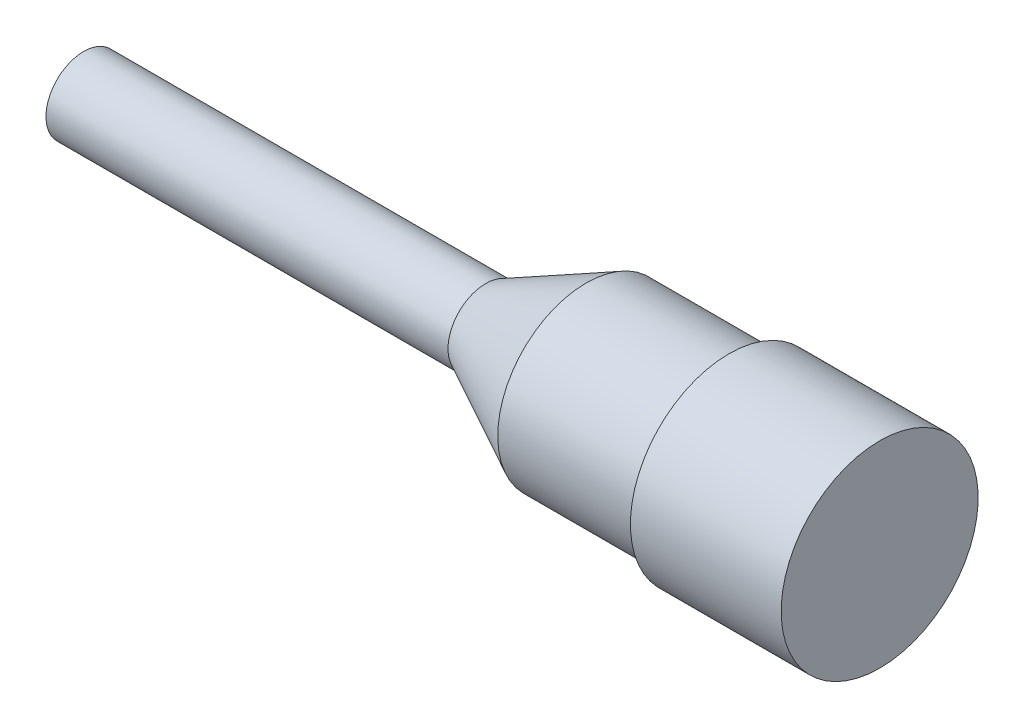
ISO-10303-21;
HEADER;
FILE_DESCRIPTION(('STEP AP214'),'2;1');
FILE_NAME('part.step','',(''),(''),'','','');
FILE_SCHEMA(('AUTOMOTIVE_DESIGN { 1 0 10303 214 1 1 1 1 }'));
ENDSEC;
DATA;
#1=APPLICATION_CONTEXT('core data for automotive mechanical design processes');
#2=APPLICATION_PROTOCOL_DEFINITION('international standard','automotive_design',2000,#1);
#3=PRODUCT_CONTEXT('',#1,'mechanical');
#4=PRODUCT('Part','Part','',(#3));
#5=PRODUCT_RELATED_PRODUCT_CATEGORY('part','',(#4));
#6=PRODUCT_DEFINITION_FORMATION('','',#4);
#7=PRODUCT_DEFINITION_CONTEXT('part definition',#1,'design');
#8=PRODUCT_DEFINITION('design','',#6,#7);
#9=PRODUCT_DEFINITION_SHAPE('','',#8);
#10=(LENGTH_UNIT() NAMED_UNIT(*) SI_UNIT(.MILLI.,.METRE.));
#11=(NAMED_UNIT(*) PLANE_ANGLE_UNIT() SI_UNIT($,.RADIAN.));
#12=(NAMED_UNIT(*) SI_UNIT($,.STERADIAN.) SOLID_ANGLE_UNIT());
#13=UNCERTAINTY_MEASURE_WITH_UNIT(LENGTH_MEASURE(1.E-05),#10,'distance_accuracy_value','');
#14=(GEOMETRIC_REPRESENTATION_CONTEXT(3) GLOBAL_UNCERTAINTY_ASSIGNED_CONTEXT((#13)) GLOBAL_UNIT_ASSIGNED_CONTEXT((#10,
#11,#12)) REPRESENTATION_CONTEXT('',''));
#15=CARTESIAN_POINT('',(0.,0.,0.));
#16=DIRECTION('',(0.,0.,1.));
#17=DIRECTION('',(1.,0.,0.));
#18=AXIS2_PLACEMENT_3D('',#15,#16,#17);
#19=CARTESIAN_POINT('',(0.,12.446,0.));
#20=DIRECTION('',(1.,0.,0.));
#21=DIRECTION('',(0.,1.,0.));
#22=AXIS2_PLACEMENT_3D('',#19,#20,#21);
#23=PLANE('',#22);
#24=CARTESIAN_POINT('',(0.,0.,0.));
#25=DIRECTION('',(1.,0.,0.));
#26=DIRECTION('',(0.,1.,0.));
#27=AXIS2_PLACEMENT_3D('',#24,#25,#26);
#28=CIRCLE('',#27,12.446);
#29=CARTESIAN_POINT('',(0.,12.446,0.));
#30=VERTEX_POINT('',#29);
#31=EDGE_CURVE('E56',#30,#30,#28,.T.);
#32=ORIENTED_EDGE('',*,*,#31,.T.);
#33=EDGE_LOOP('',(#32));
#34=FACE_BOUND('',#33,.T.);
#35=ADVANCED_FACE('F34',(#34),#23,.T.);
#36=CARTESIAN_POINT('',(-100.584,0.,0.));
#37=DIRECTION('',(-1.,0.,0.));
#38=DIRECTION('',(0.,-1.,0.));
#39=AXIS2_PLACEMENT_3D('',#36,#37,#38);
#40=PLANE('',#39);
#41=CARTESIAN_POINT('',(-100.584,0.,0.));
#42=DIRECTION('',(1.,0.,0.));
#43=DIRECTION('',(0.,1.,0.));
#44=AXIS2_PLACEMENT_3D('',#41,#42,#43);
#45=CIRCLE('',#44,4.76250000000001);
#46=CARTESIAN_POINT('',(-100.584,4.76249999999999,0.));
#47=VERTEX_POINT('',#46);
#48=EDGE_CURVE('E10',#47,#47,#45,.T.);
#49=ORIENTED_EDGE('',*,*,#48,.F.);
#50=EDGE_LOOP('',(#49));
#51=FACE_BOUND('',#50,.T.);
#52=ADVANCED_FACE('F73',(#51),#40,.T.);
#53=CARTESIAN_POINT('',(0.,0.,0.));
#54=DIRECTION('',(1.,0.,0.));
#55=DIRECTION('',(0.,1.,0.));
#56=AXIS2_PLACEMENT_3D('',#53,#54,#55);
#57=CYLINDRICAL_SURFACE('',#56,4.7625);
#58=ORIENTED_EDGE('',*,*,#48,.T.);
#59=EDGE_LOOP('',(#58));
#60=FACE_BOUND('',#59,.T.);
#61=CARTESIAN_POINT('',(-49.784,0.,0.));
#62=DIRECTION('',(1.,0.,0.));
#63=DIRECTION('',(0.,1.,0.));
#64=AXIS2_PLACEMENT_3D('',#61,#62,#63);
#65=CIRCLE('',#64,4.7625);
#66=CARTESIAN_POINT('',(-49.784,4.76249999999999,0.));
#67=VERTEX_POINT('',#66);
#68=EDGE_CURVE('E40',#67,#67,#65,.T.);
#69=ORIENTED_EDGE('',*,*,#68,.F.);
#70=EDGE_LOOP('',(#69));
#71=FACE_BOUND('',#70,.T.);
#72=ADVANCED_FACE('F77',(#60,#71),#57,.T.);
#73=CARTESIAN_POINT('',(-37.084,0.,0.));
#74=DIRECTION('',(1.,0.,0.));
#75=DIRECTION('',(0.,1.,0.));
#76=AXIS2_PLACEMENT_3D('',#73,#74,#75);
#77=CONICAL_SURFACE('',#76,11.176,0.467639603763229);
#78=ORIENTED_EDGE('',*,*,#68,.T.);
#79=EDGE_LOOP('',(#78));
#80=FACE_BOUND('',#79,.T.);
#81=CARTESIAN_POINT('',(-37.084,0.,0.));
#82=DIRECTION('',(1.,0.,0.));
#83=DIRECTION('',(0.,1.,0.));
#84=AXIS2_PLACEMENT_3D('',#81,#82,#83);
#85=CIRCLE('',#84,11.176);
#86=CARTESIAN_POINT('',(-37.084,11.176,0.));
#87=VERTEX_POINT('',#86);
#88=EDGE_CURVE('E44',#87,#87,#85,.T.);
#89=ORIENTED_EDGE('',*,*,#88,.F.);
#90=EDGE_LOOP('',(#89));
#91=FACE_BOUND('',#90,.T.);
#92=ADVANCED_FACE('F82',(#80,#91),#77,.T.);
#93=CARTESIAN_POINT('',(0.,0.,0.));
#94=DIRECTION('',(1.,0.,0.));
#95=DIRECTION('',(0.,1.,0.));
#96=AXIS2_PLACEMENT_3D('',#93,#94,#95);
#97=CYLINDRICAL_SURFACE('',#96,11.176);
#98=ORIENTED_EDGE('',*,*,#88,.T.);
#99=EDGE_LOOP('',(#98));
#100=FACE_BOUND('',#99,.T.);
#101=CARTESIAN_POINT('',(-19.05,0.,0.));
#102=DIRECTION('',(1.,0.,0.));
#103=DIRECTION('',(0.,1.,0.));
#104=AXIS2_PLACEMENT_3D('',#101,#102,#103);
#105=CIRCLE('',#104,11.176);
#106=CARTESIAN_POINT('',(-19.05,11.176,0.));
#107=VERTEX_POINT('',#106);
#108=EDGE_CURVE('E48',#107,#107,#105,.T.);
#109=ORIENTED_EDGE('',*,*,#108,.F.);
#110=EDGE_LOOP('',(#109));
#111=FACE_BOUND('',#110,.T.);
#112=ADVANCED_FACE('F69',(#100,#111),#97,.T.);
#113=CARTESIAN_POINT('',(-19.05,11.176,0.));
#114=DIRECTION('',(-1.,0.,0.));
#115=DIRECTION('',(0.,-1.,0.));
#116=AXIS2_PLACEMENT_3D('',#113,#114,#115);
#117=PLANE('',#116);
#118=ORIENTED_EDGE('',*,*,#108,.T.);
#119=EDGE_LOOP('',(#118));
#120=FACE_BOUND('',#119,.T.);
#121=CARTESIAN_POINT('',(-19.05,0.,0.));
#122=DIRECTION('',(1.,0.,0.));
#123=DIRECTION('',(0.,1.,0.));
#124=AXIS2_PLACEMENT_3D('',#121,#122,#123);
#125=CIRCLE('',#124,12.446);
#126=CARTESIAN_POINT('',(-19.05,12.446,0.));
#127=VERTEX_POINT('',#126);
#128=EDGE_CURVE('E53',#127,#127,#125,.T.);
#129=ORIENTED_EDGE('',*,*,#128,.F.);
#130=EDGE_LOOP('',(#129));
#131=FACE_BOUND('',#130,.T.);
#132=ADVANCED_FACE('F63',(#120,#131),#117,.T.);
#133=CARTESIAN_POINT('',(0.,0.,0.));
#134=DIRECTION('',(1.,0.,0.));
#135=DIRECTION('',(0.,1.,0.));
#136=AXIS2_PLACEMENT_3D('',#133,#134,#135);
#137=CYLINDRICAL_SURFACE('',#136,12.446);
#138=ORIENTED_EDGE('',*,*,#128,.T.);
#139=EDGE_LOOP('',(#138));
#140=FACE_BOUND('',#139,.T.);
#141=ORIENTED_EDGE('',*,*,#31,.F.);
#142=EDGE_LOOP('',(#141));
#143=FACE_BOUND('',#142,.T.);
#144=ADVANCED_FACE('F61',(#140,#143),#137,.T.);
#145=CLOSED_SHELL('',(#35,#52,#72,#92,#112,#132,#144));
#146=MANIFOLD_SOLID_BREP('B2',#145);
#147=ADVANCED_BREP_SHAPE_REPRESENTATION('',(#18,#146),#14);
#148=SHAPE_DEFINITION_REPRESENTATION(#9,#147);
ENDSEC;
END-ISO-10303-21;
